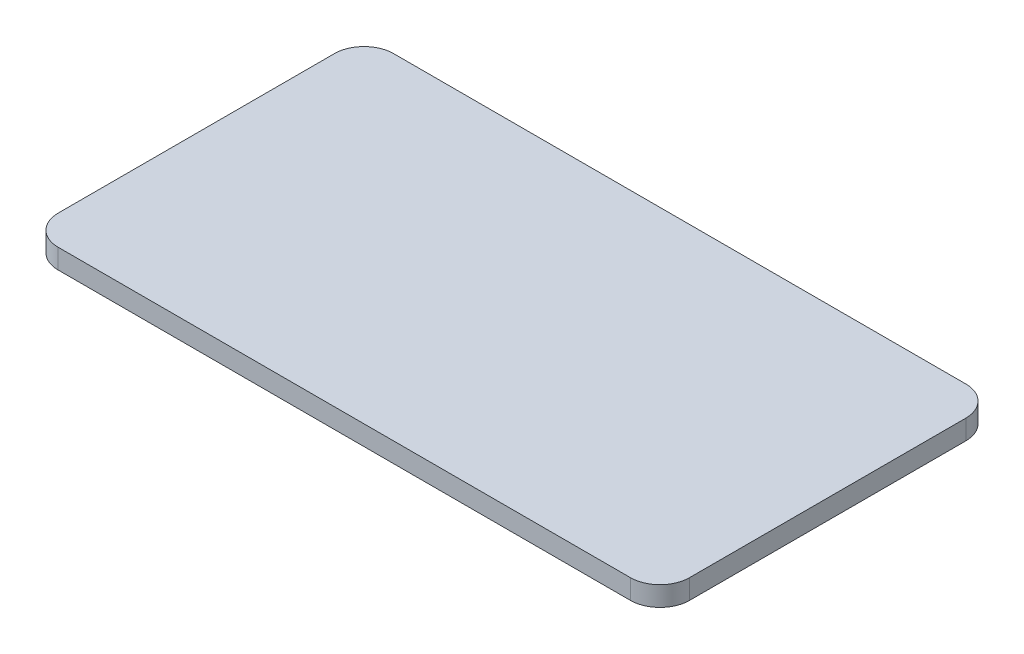
ISO-10303-21;
HEADER;
FILE_DESCRIPTION(('STEP AP214'),'2;1');
FILE_NAME('part.step','',(''),(''),'','','');
FILE_SCHEMA(('AUTOMOTIVE_DESIGN { 1 0 10303 214 1 1 1 1 }'));
ENDSEC;
DATA;
#1=APPLICATION_CONTEXT('core data for automotive mechanical design processes');
#2=APPLICATION_PROTOCOL_DEFINITION('international standard','automotive_design',2000,#1);
#3=PRODUCT_CONTEXT('',#1,'mechanical');
#4=PRODUCT('Part','Part','',(#3));
#5=PRODUCT_RELATED_PRODUCT_CATEGORY('part','',(#4));
#6=PRODUCT_DEFINITION_FORMATION('','',#4);
#7=PRODUCT_DEFINITION_CONTEXT('part definition',#1,'design');
#8=PRODUCT_DEFINITION('design','',#6,#7);
#9=PRODUCT_DEFINITION_SHAPE('','',#8);
#10=(LENGTH_UNIT() NAMED_UNIT(*) SI_UNIT(.MILLI.,.METRE.));
#11=(NAMED_UNIT(*) PLANE_ANGLE_UNIT() SI_UNIT($,.RADIAN.));
#12=(NAMED_UNIT(*) SI_UNIT($,.STERADIAN.) SOLID_ANGLE_UNIT());
#13=UNCERTAINTY_MEASURE_WITH_UNIT(LENGTH_MEASURE(1.E-05),#10,'distance_accuracy_value','');
#14=(GEOMETRIC_REPRESENTATION_CONTEXT(3) GLOBAL_UNCERTAINTY_ASSIGNED_CONTEXT((#13)) GLOBAL_UNIT_ASSIGNED_CONTEXT((#10,
#11,#12)) REPRESENTATION_CONTEXT('',''));
#15=CARTESIAN_POINT('',(0.,0.,0.));
#16=DIRECTION('',(0.,0.,1.));
#17=DIRECTION('',(1.,0.,0.));
#18=AXIS2_PLACEMENT_3D('',#15,#16,#17);
#19=CARTESIAN_POINT('',(3.,2.,-3.));
#20=DIRECTION('',(0.,-1.,0.));
#21=DIRECTION('',(0.,0.,-1.));
#22=AXIS2_PLACEMENT_3D('',#19,#20,#21);
#23=CYLINDRICAL_SURFACE('',#22,3.);
#24=CARTESIAN_POINT('',(3.,0.,-3.));
#25=DIRECTION('',(0.,1.,0.));
#26=DIRECTION('',(0.,0.,-1.));
#27=AXIS2_PLACEMENT_3D('',#24,#25,#26);
#28=CIRCLE('',#27,3.);
#29=CARTESIAN_POINT('',(0.,0.,-3.00000000000002));
#30=VERTEX_POINT('',#29);
#31=CARTESIAN_POINT('',(3.00000000000002,0.,0.));
#32=VERTEX_POINT('',#31);
#33=EDGE_CURVE('E140',#30,#32,#28,.T.);
#34=ORIENTED_EDGE('',*,*,#33,.T.);
#35=DIRECTION('',(0.,-1.,0.));
#36=VECTOR('',#35,1.);
#37=CARTESIAN_POINT('',(3.00000000000002,2.,0.));
#38=LINE('',#37,#36);
#39=CARTESIAN_POINT('',(3.00000000000002,2.,0.));
#40=VERTEX_POINT('',#39);
#41=EDGE_CURVE('E11',#40,#32,#38,.T.);
#42=ORIENTED_EDGE('',*,*,#41,.F.);
#43=CARTESIAN_POINT('',(3.,2.,-3.));
#44=DIRECTION('',(0.,1.,0.));
#45=DIRECTION('',(0.,0.,-1.));
#46=AXIS2_PLACEMENT_3D('',#43,#44,#45);
#47=CIRCLE('',#46,3.);
#48=CARTESIAN_POINT('',(0.,2.,-3.00000000000002));
#49=VERTEX_POINT('',#48);
#50=EDGE_CURVE('E162',#49,#40,#47,.T.);
#51=ORIENTED_EDGE('',*,*,#50,.F.);
#52=DIRECTION('',(0.,-1.,0.));
#53=VECTOR('',#52,1.);
#54=CARTESIAN_POINT('',(0.,2.,-3.00000000000002));
#55=LINE('',#54,#53);
#56=EDGE_CURVE('E136',#49,#30,#55,.T.);
#57=ORIENTED_EDGE('',*,*,#56,.T.);
#58=EDGE_LOOP('',(#34,#42,#51,#57));
#59=FACE_BOUND('',#58,.T.);
#60=ADVANCED_FACE('F39',(#59),#23,.T.);
#61=CARTESIAN_POINT('',(3.00000000000002,2.,0.));
#62=DIRECTION('',(0.,0.,-1.));
#63=DIRECTION('',(-1.,0.,0.));
#64=AXIS2_PLACEMENT_3D('',#61,#62,#63);
#65=PLANE('',#64);
#66=DIRECTION('',(1.,0.,0.));
#67=VECTOR('',#66,1.);
#68=CARTESIAN_POINT('',(3.00000000000002,0.,0.));
#69=LINE('',#68,#67);
#70=CARTESIAN_POINT('',(61.,0.,0.));
#71=VERTEX_POINT('',#70);
#72=EDGE_CURVE('E144',#32,#71,#69,.T.);
#73=ORIENTED_EDGE('',*,*,#72,.T.);
#74=DIRECTION('',(0.,-1.,0.));
#75=VECTOR('',#74,1.);
#76=CARTESIAN_POINT('',(61.,2.,0.));
#77=LINE('',#76,#75);
#78=CARTESIAN_POINT('',(61.,2.,0.));
#79=VERTEX_POINT('',#78);
#80=EDGE_CURVE('E48',#79,#71,#77,.T.);
#81=ORIENTED_EDGE('',*,*,#80,.F.);
#82=DIRECTION('',(1.,0.,0.));
#83=VECTOR('',#82,1.);
#84=CARTESIAN_POINT('',(3.00000000000002,2.,0.));
#85=LINE('',#84,#83);
#86=EDGE_CURVE('E99',#40,#79,#85,.T.);
#87=ORIENTED_EDGE('',*,*,#86,.F.);
#88=ORIENTED_EDGE('',*,*,#41,.T.);
#89=EDGE_LOOP('',(#73,#81,#87,#88));
#90=FACE_BOUND('',#89,.T.);
#91=ADVANCED_FACE('F208',(#90),#65,.F.);
#92=CARTESIAN_POINT('',(61.,2.,-3.));
#93=DIRECTION('',(0.,-1.,0.));
#94=DIRECTION('',(0.,0.,-1.));
#95=AXIS2_PLACEMENT_3D('',#92,#93,#94);
#96=CYLINDRICAL_SURFACE('',#95,3.);
#97=CARTESIAN_POINT('',(61.,0.,-3.));
#98=DIRECTION('',(0.,1.,0.));
#99=DIRECTION('',(0.,0.,1.));
#100=AXIS2_PLACEMENT_3D('',#97,#98,#99);
#101=CIRCLE('',#100,3.);
#102=CARTESIAN_POINT('',(64.,0.,-3.00000000000002));
#103=VERTEX_POINT('',#102);
#104=EDGE_CURVE('E147',#71,#103,#101,.T.);
#105=ORIENTED_EDGE('',*,*,#104,.T.);
#106=DIRECTION('',(0.,-1.,0.));
#107=VECTOR('',#106,1.);
#108=CARTESIAN_POINT('',(64.,2.,-3.00000000000002));
#109=LINE('',#108,#107);
#110=CARTESIAN_POINT('',(64.,2.,-3.00000000000002));
#111=VERTEX_POINT('',#110);
#112=EDGE_CURVE('E173',#111,#103,#109,.T.);
#113=ORIENTED_EDGE('',*,*,#112,.F.);
#114=CARTESIAN_POINT('',(61.,2.,-3.));
#115=DIRECTION('',(0.,1.,0.));
#116=DIRECTION('',(0.,0.,1.));
#117=AXIS2_PLACEMENT_3D('',#114,#115,#116);
#118=CIRCLE('',#117,3.);
#119=EDGE_CURVE('E183',#79,#111,#118,.T.);
#120=ORIENTED_EDGE('',*,*,#119,.F.);
#121=ORIENTED_EDGE('',*,*,#80,.T.);
#122=EDGE_LOOP('',(#105,#113,#120,#121));
#123=FACE_BOUND('',#122,.T.);
#124=ADVANCED_FACE('F181',(#123),#96,.T.);
#125=CARTESIAN_POINT('',(64.,2.,-3.00000000000002));
#126=DIRECTION('',(-1.,0.,0.));
#127=DIRECTION('',(0.,0.,1.));
#128=AXIS2_PLACEMENT_3D('',#125,#126,#127);
#129=PLANE('',#128);
#130=DIRECTION('',(0.,0.,-1.));
#131=VECTOR('',#130,1.);
#132=CARTESIAN_POINT('',(64.,0.,-3.00000000000002));
#133=LINE('',#132,#131);
#134=CARTESIAN_POINT('',(64.,0.,-31.));
#135=VERTEX_POINT('',#134);
#136=EDGE_CURVE('E150',#103,#135,#133,.T.);
#137=ORIENTED_EDGE('',*,*,#136,.T.);
#138=DIRECTION('',(0.,-1.,0.));
#139=VECTOR('',#138,1.);
#140=CARTESIAN_POINT('',(64.,2.,-31.));
#141=LINE('',#140,#139);
#142=CARTESIAN_POINT('',(64.,2.,-31.));
#143=VERTEX_POINT('',#142);
#144=EDGE_CURVE('E169',#143,#135,#141,.T.);
#145=ORIENTED_EDGE('',*,*,#144,.F.);
#146=DIRECTION('',(0.,0.,-1.));
#147=VECTOR('',#146,1.);
#148=CARTESIAN_POINT('',(64.,2.,-3.00000000000002));
#149=LINE('',#148,#147);
#150=EDGE_CURVE('E196',#111,#143,#149,.T.);
#151=ORIENTED_EDGE('',*,*,#150,.F.);
#152=ORIENTED_EDGE('',*,*,#112,.T.);
#153=EDGE_LOOP('',(#137,#145,#151,#152));
#154=FACE_BOUND('',#153,.T.);
#155=ADVANCED_FACE('F191',(#154),#129,.F.);
#156=CARTESIAN_POINT('',(61.,2.,-31.));
#157=DIRECTION('',(0.,-1.,0.));
#158=DIRECTION('',(0.,0.,-1.));
#159=AXIS2_PLACEMENT_3D('',#156,#157,#158);
#160=CYLINDRICAL_SURFACE('',#159,3.);
#161=CARTESIAN_POINT('',(61.,0.,-31.));
#162=DIRECTION('',(0.,1.,0.));
#163=DIRECTION('',(0.,0.,-1.));
#164=AXIS2_PLACEMENT_3D('',#161,#162,#163);
#165=CIRCLE('',#164,3.);
#166=CARTESIAN_POINT('',(61.,0.,-34.));
#167=VERTEX_POINT('',#166);
#168=EDGE_CURVE('E153',#135,#167,#165,.T.);
#169=ORIENTED_EDGE('',*,*,#168,.T.);
#170=DIRECTION('',(0.,-1.,0.));
#171=VECTOR('',#170,1.);
#172=CARTESIAN_POINT('',(61.,2.,-34.));
#173=LINE('',#172,#171);
#174=CARTESIAN_POINT('',(61.,2.,-34.));
#175=VERTEX_POINT('',#174);
#176=EDGE_CURVE('E129',#175,#167,#173,.T.);
#177=ORIENTED_EDGE('',*,*,#176,.F.);
#178=CARTESIAN_POINT('',(61.,2.,-31.));
#179=DIRECTION('',(0.,1.,0.));
#180=DIRECTION('',(0.,0.,-1.));
#181=AXIS2_PLACEMENT_3D('',#178,#179,#180);
#182=CIRCLE('',#181,3.);
#183=EDGE_CURVE('E118',#143,#175,#182,.T.);
#184=ORIENTED_EDGE('',*,*,#183,.F.);
#185=ORIENTED_EDGE('',*,*,#144,.T.);
#186=EDGE_LOOP('',(#169,#177,#184,#185));
#187=FACE_BOUND('',#186,.T.);
#188=ADVANCED_FACE('F194',(#187),#160,.T.);
#189=CARTESIAN_POINT('',(3.00000000000002,2.,-34.));
#190=DIRECTION('',(0.,0.,1.));
#191=DIRECTION('',(1.,0.,0.));
#192=AXIS2_PLACEMENT_3D('',#189,#190,#191);
#193=PLANE('',#192);
#194=DIRECTION('',(-1.,0.,0.));
#195=VECTOR('',#194,1.);
#196=CARTESIAN_POINT('',(3.00000000000002,0.,-34.));
#197=LINE('',#196,#195);
#198=CARTESIAN_POINT('',(3.00000000000002,0.,-34.));
#199=VERTEX_POINT('',#198);
#200=EDGE_CURVE('E127',#167,#199,#197,.T.);
#201=ORIENTED_EDGE('',*,*,#200,.T.);
#202=DIRECTION('',(0.,-1.,0.));
#203=VECTOR('',#202,1.);
#204=CARTESIAN_POINT('',(3.00000000000002,2.,-34.));
#205=LINE('',#204,#203);
#206=CARTESIAN_POINT('',(3.00000000000002,2.,-34.));
#207=VERTEX_POINT('',#206);
#208=EDGE_CURVE('E124',#207,#199,#205,.T.);
#209=ORIENTED_EDGE('',*,*,#208,.F.);
#210=DIRECTION('',(-1.,0.,0.));
#211=VECTOR('',#210,1.);
#212=CARTESIAN_POINT('',(3.00000000000002,2.,-34.));
#213=LINE('',#212,#211);
#214=EDGE_CURVE('E112',#175,#207,#213,.T.);
#215=ORIENTED_EDGE('',*,*,#214,.F.);
#216=ORIENTED_EDGE('',*,*,#176,.T.);
#217=EDGE_LOOP('',(#201,#209,#215,#216));
#218=FACE_BOUND('',#217,.T.);
#219=ADVANCED_FACE('F125',(#218),#193,.F.);
#220=CARTESIAN_POINT('',(3.,2.,-31.));
#221=DIRECTION('',(0.,-1.,0.));
#222=DIRECTION('',(0.,0.,-1.));
#223=AXIS2_PLACEMENT_3D('',#220,#221,#222);
#224=CYLINDRICAL_SURFACE('',#223,3.);
#225=CARTESIAN_POINT('',(3.,0.,-31.));
#226=DIRECTION('',(0.,1.,0.));
#227=DIRECTION('',(0.,0.,-1.));
#228=AXIS2_PLACEMENT_3D('',#225,#226,#227);
#229=CIRCLE('',#228,3.);
#230=CARTESIAN_POINT('',(0.,0.,-31.));
#231=VERTEX_POINT('',#230);
#232=EDGE_CURVE('E85',#199,#231,#229,.T.);
#233=ORIENTED_EDGE('',*,*,#232,.T.);
#234=DIRECTION('',(0.,-1.,0.));
#235=VECTOR('',#234,1.);
#236=CARTESIAN_POINT('',(0.,2.,-31.));
#237=LINE('',#236,#235);
#238=CARTESIAN_POINT('',(0.,2.,-31.));
#239=VERTEX_POINT('',#238);
#240=EDGE_CURVE('E130',#239,#231,#237,.T.);
#241=ORIENTED_EDGE('',*,*,#240,.F.);
#242=CARTESIAN_POINT('',(3.,2.,-31.));
#243=DIRECTION('',(0.,1.,0.));
#244=DIRECTION('',(0.,0.,-1.));
#245=AXIS2_PLACEMENT_3D('',#242,#243,#244);
#246=CIRCLE('',#245,3.);
#247=EDGE_CURVE('E116',#207,#239,#246,.T.);
#248=ORIENTED_EDGE('',*,*,#247,.F.);
#249=ORIENTED_EDGE('',*,*,#208,.T.);
#250=EDGE_LOOP('',(#233,#241,#248,#249));
#251=FACE_BOUND('',#250,.T.);
#252=ADVANCED_FACE('F132',(#251),#224,.T.);
#253=CARTESIAN_POINT('',(0.,2.,-3.00000000000002));
#254=DIRECTION('',(1.,0.,0.));
#255=DIRECTION('',(0.,0.,-1.));
#256=AXIS2_PLACEMENT_3D('',#253,#254,#255);
#257=PLANE('',#256);
#258=DIRECTION('',(0.,0.,1.));
#259=VECTOR('',#258,1.);
#260=CARTESIAN_POINT('',(0.,0.,-3.00000000000002));
#261=LINE('',#260,#259);
#262=EDGE_CURVE('E91',#231,#30,#261,.T.);
#263=ORIENTED_EDGE('',*,*,#262,.T.);
#264=ORIENTED_EDGE('',*,*,#56,.F.);
#265=DIRECTION('',(0.,0.,1.));
#266=VECTOR('',#265,1.);
#267=CARTESIAN_POINT('',(0.,2.,-3.00000000000002));
#268=LINE('',#267,#266);
#269=EDGE_CURVE('E56',#239,#49,#268,.T.);
#270=ORIENTED_EDGE('',*,*,#269,.F.);
#271=ORIENTED_EDGE('',*,*,#240,.T.);
#272=EDGE_LOOP('',(#263,#264,#270,#271));
#273=FACE_BOUND('',#272,.T.);
#274=ADVANCED_FACE('F224',(#273),#257,.F.);
#275=CARTESIAN_POINT('',(3.,2.,-3.));
#276=DIRECTION('',(0.,-1.,0.));
#277=DIRECTION('',(0.,0.,-1.));
#278=AXIS2_PLACEMENT_3D('',#275,#276,#277);
#279=PLANE('',#278);
#280=ORIENTED_EDGE('',*,*,#50,.T.);
#281=ORIENTED_EDGE('',*,*,#86,.T.);
#282=ORIENTED_EDGE('',*,*,#119,.T.);
#283=ORIENTED_EDGE('',*,*,#150,.T.);
#284=ORIENTED_EDGE('',*,*,#183,.T.);
#285=ORIENTED_EDGE('',*,*,#214,.T.);
#286=ORIENTED_EDGE('',*,*,#247,.T.);
#287=ORIENTED_EDGE('',*,*,#269,.T.);
#288=EDGE_LOOP('',(#280,#281,#282,#283,#284,#285,#286,#287));
#289=FACE_BOUND('',#288,.T.);
#290=ADVANCED_FACE('F114',(#289),#279,.F.);
#291=CARTESIAN_POINT('',(3.,0.,-3.));
#292=DIRECTION('',(0.,-1.,0.));
#293=DIRECTION('',(0.,0.,-1.));
#294=AXIS2_PLACEMENT_3D('',#291,#292,#293);
#295=PLANE('',#294);
#296=ORIENTED_EDGE('',*,*,#33,.F.);
#297=ORIENTED_EDGE('',*,*,#262,.F.);
#298=ORIENTED_EDGE('',*,*,#232,.F.);
#299=ORIENTED_EDGE('',*,*,#200,.F.);
#300=ORIENTED_EDGE('',*,*,#168,.F.);
#301=ORIENTED_EDGE('',*,*,#136,.F.);
#302=ORIENTED_EDGE('',*,*,#104,.F.);
#303=ORIENTED_EDGE('',*,*,#72,.F.);
#304=EDGE_LOOP('',(#296,#297,#298,#299,#300,#301,#302,#303));
#305=FACE_BOUND('',#304,.T.);
#306=ADVANCED_FACE('F187',(#305),#295,.T.);
#307=CLOSED_SHELL('',(#60,#91,#124,#155,#188,#219,#252,#274,#290,#306));
#308=MANIFOLD_SOLID_BREP('B2',#307);
#309=ADVANCED_BREP_SHAPE_REPRESENTATION('',(#18,#308),#14);
#310=SHAPE_DEFINITION_REPRESENTATION(#9,#309);
ENDSEC;
END-ISO-10303-21;
